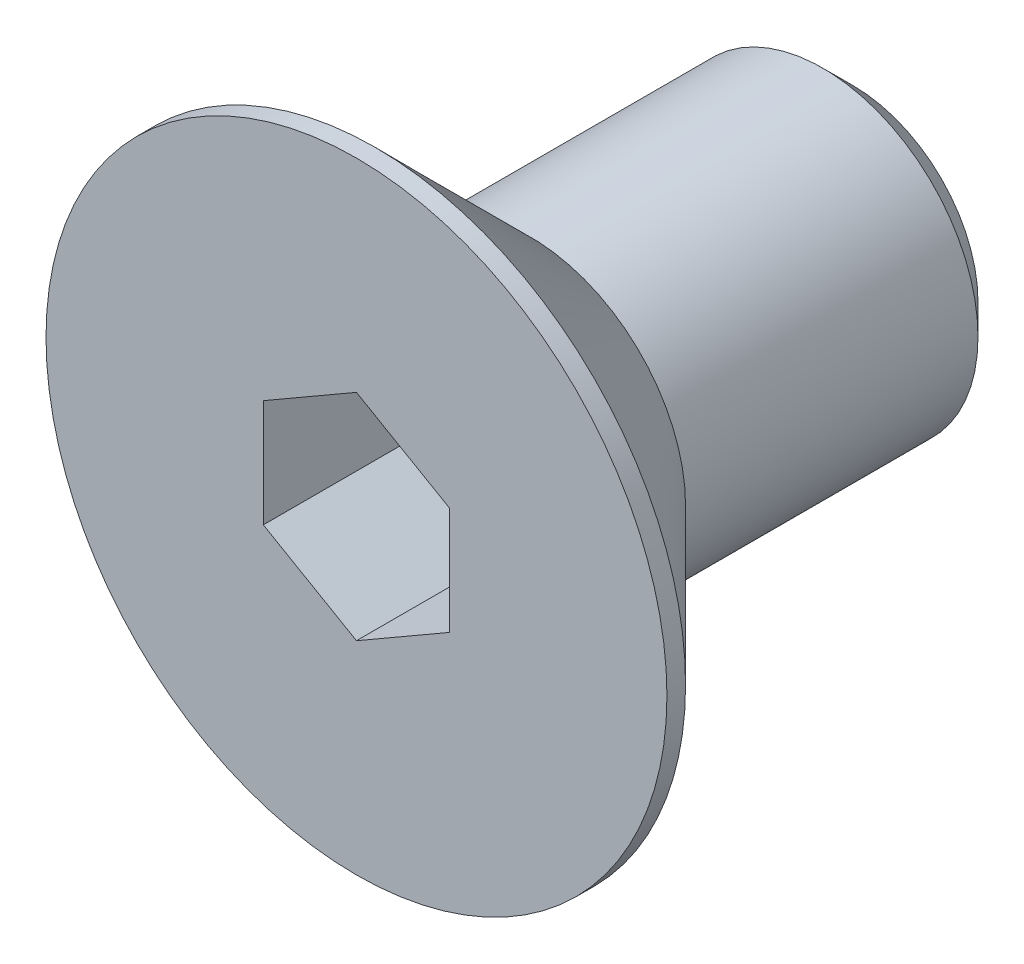
ISO-10303-21;
HEADER;
FILE_DESCRIPTION(('STEP AP214'),'2;1');
FILE_NAME('part.step','',(''),(''),'','','');
FILE_SCHEMA(('AUTOMOTIVE_DESIGN { 1 0 10303 214 1 1 1 1 }'));
ENDSEC;
DATA;
#1=APPLICATION_CONTEXT('core data for automotive mechanical design processes');
#2=APPLICATION_PROTOCOL_DEFINITION('international standard','automotive_design',2000,#1);
#3=PRODUCT_CONTEXT('',#1,'mechanical');
#4=PRODUCT('Part','Part','',(#3));
#5=PRODUCT_RELATED_PRODUCT_CATEGORY('part','',(#4));
#6=PRODUCT_DEFINITION_FORMATION('','',#4);
#7=PRODUCT_DEFINITION_CONTEXT('part definition',#1,'design');
#8=PRODUCT_DEFINITION('design','',#6,#7);
#9=PRODUCT_DEFINITION_SHAPE('','',#8);
#10=(LENGTH_UNIT() NAMED_UNIT(*) SI_UNIT(.MILLI.,.METRE.));
#11=(NAMED_UNIT(*) PLANE_ANGLE_UNIT() SI_UNIT($,.RADIAN.));
#12=(NAMED_UNIT(*) SI_UNIT($,.STERADIAN.) SOLID_ANGLE_UNIT());
#13=UNCERTAINTY_MEASURE_WITH_UNIT(LENGTH_MEASURE(1.E-05),#10,'distance_accuracy_value','');
#14=(GEOMETRIC_REPRESENTATION_CONTEXT(3) GLOBAL_UNCERTAINTY_ASSIGNED_CONTEXT((#13)) GLOBAL_UNIT_ASSIGNED_CONTEXT((#10,
#11,#12)) REPRESENTATION_CONTEXT('',''));
#15=CARTESIAN_POINT('',(0.,0.,0.));
#16=DIRECTION('',(0.,0.,1.));
#17=DIRECTION('',(1.,0.,0.));
#18=AXIS2_PLACEMENT_3D('',#15,#16,#17);
#19=CARTESIAN_POINT('',(0.,0.,-4.24));
#20=DIRECTION('',(0.,0.,1.));
#21=DIRECTION('',(1.,0.,0.));
#22=AXIS2_PLACEMENT_3D('',#19,#20,#21);
#23=PLANE('',#22);
#24=DIRECTION('',(0.,-1.,0.));
#25=VECTOR('',#24,1.);
#26=CARTESIAN_POINT('',(-17.5,29.2660254037844,-4.24));
#27=LINE('',#26,#25);
#28=CARTESIAN_POINT('',(-17.5,29.2660254037844,-4.24));
#29=VERTEX_POINT('',#28);
#30=CARTESIAN_POINT('',(-17.5,28.4,-4.24000000000797));
#31=VERTEX_POINT('',#30);
#32=EDGE_CURVE('E263',#29,#31,#27,.T.);
#33=ORIENTED_EDGE('',*,*,#32,.T.);
#34=CARTESIAN_POINT('',(-16.,28.4,-4.24000000000797));
#35=DIRECTION('',(0.,0.,-1.));
#36=DIRECTION('',(-1.,0.,0.));
#37=AXIS2_PLACEMENT_3D('',#34,#35,#36);
#38=CIRCLE('',#37,1.49999999998808);
#39=CARTESIAN_POINT('',(-16.7499999999941,29.6990381056663,-4.24000000000797));
#40=VERTEX_POINT('',#39);
#41=EDGE_CURVE('E50',#31,#40,#38,.T.);
#42=ORIENTED_EDGE('',*,*,#41,.T.);
#43=DIRECTION('',(-0.866025403784432,-0.500000000000012,0.));
#44=VECTOR('',#43,1.);
#45=CARTESIAN_POINT('',(-16.,30.1320508075689,-4.24));
#46=LINE('',#45,#44);
#47=EDGE_CURVE('E252',#40,#29,#46,.T.);
#48=ORIENTED_EDGE('',*,*,#47,.T.);
#49=EDGE_LOOP('',(#33,#42,#48));
#50=FACE_BOUND('',#49,.T.);
#51=ADVANCED_FACE('F35',(#50),#23,.T.);
#52=CARTESIAN_POINT('',(-16.,30.1320508075689,-4.24));
#53=VERTEX_POINT('',#52);
#54=EDGE_CURVE('E274',#53,#40,#46,.T.);
#55=ORIENTED_EDGE('',*,*,#54,.T.);
#56=CARTESIAN_POINT('',(-15.250000000006,29.6990381056663,-4.24000000000797));
#57=VERTEX_POINT('',#56);
#58=EDGE_CURVE('E196',#40,#57,#38,.T.);
#59=ORIENTED_EDGE('',*,*,#58,.T.);
#60=DIRECTION('',(-0.866025403784438,0.5,0.));
#61=VECTOR('',#60,1.);
#62=CARTESIAN_POINT('',(-14.5,29.2660254037844,-4.24));
#63=LINE('',#62,#61);
#64=EDGE_CURVE('E236',#57,#53,#63,.T.);
#65=ORIENTED_EDGE('',*,*,#64,.T.);
#66=EDGE_LOOP('',(#55,#59,#65));
#67=FACE_BOUND('',#66,.T.);
#68=ADVANCED_FACE('F122',(#67),#23,.T.);
#69=CARTESIAN_POINT('',(-14.5,29.2660254037844,-4.24));
#70=VERTEX_POINT('',#69);
#71=EDGE_CURVE('E237',#70,#57,#63,.T.);
#72=ORIENTED_EDGE('',*,*,#71,.T.);
#73=CARTESIAN_POINT('',(-14.5000000000119,28.4,-4.24000000000797));
#74=VERTEX_POINT('',#73);
#75=EDGE_CURVE('E199',#57,#74,#38,.T.);
#76=ORIENTED_EDGE('',*,*,#75,.T.);
#77=DIRECTION('',(0.,1.,0.));
#78=VECTOR('',#77,1.);
#79=CARTESIAN_POINT('',(-14.5,27.5339745962156,-4.24));
#80=LINE('',#79,#78);
#81=EDGE_CURVE('E231',#74,#70,#80,.T.);
#82=ORIENTED_EDGE('',*,*,#81,.T.);
#83=EDGE_LOOP('',(#72,#76,#82));
#84=FACE_BOUND('',#83,.T.);
#85=ADVANCED_FACE('F127',(#84),#23,.T.);
#86=CARTESIAN_POINT('',(-14.5,27.5339745962156,-4.24));
#87=VERTEX_POINT('',#86);
#88=EDGE_CURVE('E222',#87,#74,#80,.T.);
#89=ORIENTED_EDGE('',*,*,#88,.T.);
#90=CARTESIAN_POINT('',(-15.2500000000059,27.1009618943337,-4.24000000000797));
#91=VERTEX_POINT('',#90);
#92=EDGE_CURVE('E204',#74,#91,#38,.T.);
#93=ORIENTED_EDGE('',*,*,#92,.T.);
#94=DIRECTION('',(0.866025403784427,0.50000000000002,0.));
#95=VECTOR('',#94,1.);
#96=CARTESIAN_POINT('',(-16.,26.6679491924311,-4.24));
#97=LINE('',#96,#95);
#98=EDGE_CURVE('E219',#91,#87,#97,.T.);
#99=ORIENTED_EDGE('',*,*,#98,.T.);
#100=EDGE_LOOP('',(#89,#93,#99));
#101=FACE_BOUND('',#100,.T.);
#102=ADVANCED_FACE('F174',(#101),#23,.T.);
#103=CARTESIAN_POINT('',(-16.,26.6679491924311,-4.24));
#104=VERTEX_POINT('',#103);
#105=EDGE_CURVE('E225',#104,#91,#97,.T.);
#106=ORIENTED_EDGE('',*,*,#105,.T.);
#107=CARTESIAN_POINT('',(-16.7499999999941,27.1009618943337,-4.24000000000797));
#108=VERTEX_POINT('',#107);
#109=EDGE_CURVE('E209',#91,#108,#38,.T.);
#110=ORIENTED_EDGE('',*,*,#109,.T.);
#111=DIRECTION('',(0.866025403784423,-0.500000000000027,0.));
#112=VECTOR('',#111,1.);
#113=CARTESIAN_POINT('',(-17.5,27.5339745962156,-4.24));
#114=LINE('',#113,#112);
#115=EDGE_CURVE('E229',#108,#104,#114,.T.);
#116=ORIENTED_EDGE('',*,*,#115,.T.);
#117=EDGE_LOOP('',(#106,#110,#116));
#118=FACE_BOUND('',#117,.T.);
#119=ADVANCED_FACE('F120',(#118),#23,.T.);
#120=CARTESIAN_POINT('',(-16.,28.4,-2.));
#121=DIRECTION('',(0.,0.,-1.));
#122=DIRECTION('',(-1.,0.,0.));
#123=AXIS2_PLACEMENT_3D('',#120,#121,#122);
#124=CYLINDRICAL_SURFACE('',#123,5.00000000004061);
#125=CARTESIAN_POINT('',(-16.,28.4,-2.));
#126=DIRECTION('',(0.,0.,-1.));
#127=DIRECTION('',(-1.,0.,0.));
#128=AXIS2_PLACEMENT_3D('',#125,#126,#127);
#129=CIRCLE('',#128,5.00000000004061);
#130=CARTESIAN_POINT('',(-21.0000000000406,28.4,-2.));
#131=VERTEX_POINT('',#130);
#132=EDGE_CURVE('E179',#131,#131,#129,.T.);
#133=ORIENTED_EDGE('',*,*,#132,.T.);
#134=EDGE_LOOP('',(#133));
#135=FACE_BOUND('',#134,.T.);
#136=CARTESIAN_POINT('',(-16.,28.4,-2.30000000000505));
#137=DIRECTION('',(0.,0.,-1.));
#138=DIRECTION('',(-1.,0.,0.));
#139=AXIS2_PLACEMENT_3D('',#136,#137,#138);
#140=CIRCLE('',#139,5.00000000004061);
#141=CARTESIAN_POINT('',(-21.0000000000406,28.4,-2.30000000000505));
#142=VERTEX_POINT('',#141);
#143=EDGE_CURVE('E182',#142,#142,#140,.T.);
#144=ORIENTED_EDGE('',*,*,#143,.F.);
#145=EDGE_LOOP('',(#144));
#146=FACE_BOUND('',#145,.T.);
#147=ADVANCED_FACE('F167',(#135,#146),#124,.T.);
#148=CARTESIAN_POINT('',(-10.9999999999594,28.4,-2.));
#149=DIRECTION('',(0.,0.,1.));
#150=DIRECTION('',(1.,0.,0.));
#151=AXIS2_PLACEMENT_3D('',#148,#149,#150);
#152=PLANE('',#151);
#153=DIRECTION('',(-0.866025403784432,-0.500000000000012,0.));
#154=VECTOR('',#153,1.);
#155=CARTESIAN_POINT('',(-16.,30.1320508075689,-2.));
#156=LINE('',#155,#154);
#157=CARTESIAN_POINT('',(-16.,30.1320508075689,-2.));
#158=VERTEX_POINT('',#157);
#159=CARTESIAN_POINT('',(-17.5,29.2660254037844,-2.));
#160=VERTEX_POINT('',#159);
#161=EDGE_CURVE('E58',#158,#160,#156,.T.);
#162=ORIENTED_EDGE('',*,*,#161,.F.);
#163=DIRECTION('',(-0.866025403784438,0.5,0.));
#164=VECTOR('',#163,1.);
#165=CARTESIAN_POINT('',(-14.5,29.2660254037844,-2.));
#166=LINE('',#165,#164);
#167=CARTESIAN_POINT('',(-14.5,29.2660254037844,-2.));
#168=VERTEX_POINT('',#167);
#169=EDGE_CURVE('E250',#168,#158,#166,.T.);
#170=ORIENTED_EDGE('',*,*,#169,.F.);
#171=DIRECTION('',(0.,1.,0.));
#172=VECTOR('',#171,1.);
#173=CARTESIAN_POINT('',(-14.5,27.5339745962156,-2.));
#174=LINE('',#173,#172);
#175=CARTESIAN_POINT('',(-14.5,27.5339745962156,-2.));
#176=VERTEX_POINT('',#175);
#177=EDGE_CURVE('E247',#176,#168,#174,.T.);
#178=ORIENTED_EDGE('',*,*,#177,.F.);
#179=DIRECTION('',(0.866025403784427,0.50000000000002,0.));
#180=VECTOR('',#179,1.);
#181=CARTESIAN_POINT('',(-16.,26.6679491924311,-2.));
#182=LINE('',#181,#180);
#183=CARTESIAN_POINT('',(-16.,26.6679491924311,-2.));
#184=VERTEX_POINT('',#183);
#185=EDGE_CURVE('E245',#184,#176,#182,.T.);
#186=ORIENTED_EDGE('',*,*,#185,.F.);
#187=DIRECTION('',(0.866025403784423,-0.500000000000027,0.));
#188=VECTOR('',#187,1.);
#189=CARTESIAN_POINT('',(-17.5,27.5339745962156,-2.));
#190=LINE('',#189,#188);
#191=CARTESIAN_POINT('',(-17.5,27.5339745962156,-2.));
#192=VERTEX_POINT('',#191);
#193=EDGE_CURVE('E242',#192,#184,#190,.T.);
#194=ORIENTED_EDGE('',*,*,#193,.F.);
#195=DIRECTION('',(0.,-1.,0.));
#196=VECTOR('',#195,1.);
#197=CARTESIAN_POINT('',(-17.5,29.2660254037844,-2.));
#198=LINE('',#197,#196);
#199=EDGE_CURVE('E207',#160,#192,#198,.T.);
#200=ORIENTED_EDGE('',*,*,#199,.F.);
#201=EDGE_LOOP('',(#162,#170,#178,#186,#194,#200));
#202=FACE_BOUND('',#201,.T.);
#203=ORIENTED_EDGE('',*,*,#132,.F.);
#204=EDGE_LOOP('',(#203));
#205=FACE_BOUND('',#204,.T.);
#206=ADVANCED_FACE('F164',(#202,#205),#152,.T.);
#207=CARTESIAN_POINT('',(-16.,28.4,-10.));
#208=DIRECTION('',(0.,0.,-1.));
#209=DIRECTION('',(-1.,0.,0.));
#210=AXIS2_PLACEMENT_3D('',#207,#208,#209);
#211=PLANE('',#210);
#212=CARTESIAN_POINT('',(-16.,28.4,-10.));
#213=DIRECTION('',(0.,0.,-1.));
#214=DIRECTION('',(-1.,0.,0.));
#215=AXIS2_PLACEMENT_3D('',#212,#213,#214);
#216=CIRCLE('',#215,2.00950000009952);
#217=CARTESIAN_POINT('',(-18.0095000000995,28.4,-10.));
#218=VERTEX_POINT('',#217);
#219=EDGE_CURVE('E43',#218,#218,#216,.T.);
#220=ORIENTED_EDGE('',*,*,#219,.T.);
#221=EDGE_LOOP('',(#220));
#222=FACE_BOUND('',#221,.T.);
#223=ADVANCED_FACE('F160',(#222),#211,.T.);
#224=CARTESIAN_POINT('',(-16.,28.4,-2.));
#225=DIRECTION('',(0.,0.,-1.));
#226=DIRECTION('',(-1.,0.,0.));
#227=AXIS2_PLACEMENT_3D('',#224,#225,#226);
#228=CYLINDRICAL_SURFACE('',#227,2.5);
#229=CARTESIAN_POINT('',(-16.,28.4,-9.50950000004267));
#230=DIRECTION('',(0.,0.,-1.));
#231=DIRECTION('',(-1.,0.,0.));
#232=AXIS2_PLACEMENT_3D('',#229,#230,#231);
#233=CIRCLE('',#232,2.5);
#234=CARTESIAN_POINT('',(-18.5,28.4,-9.50950000004267));
#235=VERTEX_POINT('',#234);
#236=EDGE_CURVE('E11',#235,#235,#233,.F.);
#237=ORIENTED_EDGE('',*,*,#236,.T.);
#238=EDGE_LOOP('',(#237));
#239=FACE_BOUND('',#238,.T.);
#240=CARTESIAN_POINT('',(-16.,28.4,-4.80000000004566));
#241=DIRECTION('',(0.,0.,-1.));
#242=DIRECTION('',(-1.,0.,0.));
#243=AXIS2_PLACEMENT_3D('',#240,#241,#242);
#244=CIRCLE('',#243,2.5);
#245=CARTESIAN_POINT('',(-18.5,28.4,-4.80000000004566));
#246=VERTEX_POINT('',#245);
#247=EDGE_CURVE('E183',#246,#246,#244,.T.);
#248=ORIENTED_EDGE('',*,*,#247,.T.);
#249=EDGE_LOOP('',(#248));
#250=FACE_BOUND('',#249,.T.);
#251=ADVANCED_FACE('F156',(#239,#250),#228,.T.);
#252=CARTESIAN_POINT('',(-16.,28.4,-4.80000000004566));
#253=DIRECTION('',(0.,0.,1.));
#254=DIRECTION('',(1.,0.,0.));
#255=AXIS2_PLACEMENT_3D('',#252,#253,#254);
#256=CONICAL_SURFACE('',#255,2.5,0.785398163397448);
#257=ORIENTED_EDGE('',*,*,#143,.T.);
#258=EDGE_LOOP('',(#257));
#259=FACE_BOUND('',#258,.T.);
#260=ORIENTED_EDGE('',*,*,#247,.F.);
#261=EDGE_LOOP('',(#260));
#262=FACE_BOUND('',#261,.T.);
#263=ADVANCED_FACE('F153',(#259,#262),#256,.T.);
#264=CARTESIAN_POINT('',(-16.,30.1320508075689,-4.24));
#265=DIRECTION('',(-0.500000000000012,0.866025403784432,0.));
#266=DIRECTION('',(-0.866025403784432,-0.500000000000012,0.));
#267=AXIS2_PLACEMENT_3D('',#264,#265,#266);
#268=PLANE('',#267);
#269=ORIENTED_EDGE('',*,*,#161,.T.);
#270=DIRECTION('',(0.,0.,1.));
#271=VECTOR('',#270,1.);
#272=CARTESIAN_POINT('',(-17.5,29.2660254037844,-4.24));
#273=LINE('',#272,#271);
#274=EDGE_CURVE('E191',#29,#160,#273,.T.);
#275=ORIENTED_EDGE('',*,*,#274,.F.);
#276=ORIENTED_EDGE('',*,*,#47,.F.);
#277=ORIENTED_EDGE('',*,*,#54,.F.);
#278=DIRECTION('',(0.,0.,1.));
#279=VECTOR('',#278,1.);
#280=CARTESIAN_POINT('',(-16.,30.1320508075689,-4.24));
#281=LINE('',#280,#279);
#282=EDGE_CURVE('E184',#53,#158,#281,.T.);
#283=ORIENTED_EDGE('',*,*,#282,.T.);
#284=EDGE_LOOP('',(#269,#275,#276,#277,#283));
#285=FACE_BOUND('',#284,.T.);
#286=ADVANCED_FACE('F135',(#285),#268,.F.);
#287=CARTESIAN_POINT('',(-14.5,29.2660254037844,-4.24));
#288=DIRECTION('',(0.5,0.866025403784438,0.));
#289=DIRECTION('',(-0.866025403784439,0.5,0.));
#290=AXIS2_PLACEMENT_3D('',#287,#288,#289);
#291=PLANE('',#290);
#292=ORIENTED_EDGE('',*,*,#169,.T.);
#293=ORIENTED_EDGE('',*,*,#282,.F.);
#294=ORIENTED_EDGE('',*,*,#64,.F.);
#295=ORIENTED_EDGE('',*,*,#71,.F.);
#296=DIRECTION('',(0.,0.,1.));
#297=VECTOR('',#296,1.);
#298=CARTESIAN_POINT('',(-14.5,29.2660254037844,-4.24));
#299=LINE('',#298,#297);
#300=EDGE_CURVE('E188',#70,#168,#299,.T.);
#301=ORIENTED_EDGE('',*,*,#300,.T.);
#302=EDGE_LOOP('',(#292,#293,#294,#295,#301));
#303=FACE_BOUND('',#302,.T.);
#304=ADVANCED_FACE('F131',(#303),#291,.F.);
#305=CARTESIAN_POINT('',(-14.5,27.5339745962156,-4.24));
#306=DIRECTION('',(1.,0.,0.));
#307=DIRECTION('',(0.,1.,0.));
#308=AXIS2_PLACEMENT_3D('',#305,#306,#307);
#309=PLANE('',#308);
#310=ORIENTED_EDGE('',*,*,#177,.T.);
#311=ORIENTED_EDGE('',*,*,#300,.F.);
#312=ORIENTED_EDGE('',*,*,#81,.F.);
#313=ORIENTED_EDGE('',*,*,#88,.F.);
#314=DIRECTION('',(0.,0.,1.));
#315=VECTOR('',#314,1.);
#316=CARTESIAN_POINT('',(-14.5,27.5339745962156,-4.24));
#317=LINE('',#316,#315);
#318=EDGE_CURVE('E226',#87,#176,#317,.T.);
#319=ORIENTED_EDGE('',*,*,#318,.T.);
#320=EDGE_LOOP('',(#310,#311,#312,#313,#319));
#321=FACE_BOUND('',#320,.T.);
#322=ADVANCED_FACE('F134',(#321),#309,.F.);
#323=CARTESIAN_POINT('',(-16.,26.6679491924311,-4.24));
#324=DIRECTION('',(0.50000000000002,-0.866025403784427,0.));
#325=DIRECTION('',(0.866025403784427,0.50000000000002,0.));
#326=AXIS2_PLACEMENT_3D('',#323,#324,#325);
#327=PLANE('',#326);
#328=ORIENTED_EDGE('',*,*,#185,.T.);
#329=ORIENTED_EDGE('',*,*,#318,.F.);
#330=ORIENTED_EDGE('',*,*,#98,.F.);
#331=ORIENTED_EDGE('',*,*,#105,.F.);
#332=DIRECTION('',(0.,0.,1.));
#333=VECTOR('',#332,1.);
#334=CARTESIAN_POINT('',(-16.,26.6679491924311,-4.24));
#335=LINE('',#334,#333);
#336=EDGE_CURVE('E256',#104,#184,#335,.T.);
#337=ORIENTED_EDGE('',*,*,#336,.T.);
#338=EDGE_LOOP('',(#328,#329,#330,#331,#337));
#339=FACE_BOUND('',#338,.T.);
#340=ADVANCED_FACE('F139',(#339),#327,.F.);
#341=CARTESIAN_POINT('',(-17.5,27.5339745962156,-4.24));
#342=DIRECTION('',(-0.500000000000027,-0.866025403784423,0.));
#343=DIRECTION('',(0.866025403784423,-0.500000000000027,0.));
#344=AXIS2_PLACEMENT_3D('',#341,#342,#343);
#345=PLANE('',#344);
#346=ORIENTED_EDGE('',*,*,#193,.T.);
#347=ORIENTED_EDGE('',*,*,#336,.F.);
#348=ORIENTED_EDGE('',*,*,#115,.F.);
#349=CARTESIAN_POINT('',(-17.5,27.5339745962156,-4.24));
#350=VERTEX_POINT('',#349);
#351=EDGE_CURVE('E227',#350,#108,#114,.T.);
#352=ORIENTED_EDGE('',*,*,#351,.F.);
#353=DIRECTION('',(0.,0.,1.));
#354=VECTOR('',#353,1.);
#355=CARTESIAN_POINT('',(-17.5,27.5339745962156,-4.24));
#356=LINE('',#355,#354);
#357=EDGE_CURVE('E257',#350,#192,#356,.T.);
#358=ORIENTED_EDGE('',*,*,#357,.T.);
#359=EDGE_LOOP('',(#346,#347,#348,#352,#358));
#360=FACE_BOUND('',#359,.T.);
#361=ADVANCED_FACE('F143',(#360),#345,.F.);
#362=CARTESIAN_POINT('',(-17.5,29.2660254037844,-4.24));
#363=DIRECTION('',(-1.,0.,0.));
#364=DIRECTION('',(0.,0.,1.));
#365=AXIS2_PLACEMENT_3D('',#362,#363,#364);
#366=PLANE('',#365);
#367=ORIENTED_EDGE('',*,*,#199,.T.);
#368=ORIENTED_EDGE('',*,*,#357,.F.);
#369=EDGE_CURVE('E275',#31,#350,#27,.T.);
#370=ORIENTED_EDGE('',*,*,#369,.F.);
#371=ORIENTED_EDGE('',*,*,#32,.F.);
#372=ORIENTED_EDGE('',*,*,#274,.T.);
#373=EDGE_LOOP('',(#367,#368,#370,#371,#372));
#374=FACE_BOUND('',#373,.T.);
#375=ADVANCED_FACE('F117',(#374),#366,.F.);
#376=ORIENTED_EDGE('',*,*,#351,.T.);
#377=EDGE_CURVE('E194',#108,#31,#38,.T.);
#378=ORIENTED_EDGE('',*,*,#377,.T.);
#379=ORIENTED_EDGE('',*,*,#369,.T.);
#380=EDGE_LOOP('',(#376,#378,#379));
#381=FACE_BOUND('',#380,.T.);
#382=ADVANCED_FACE('F110',(#381),#23,.T.);
#383=CARTESIAN_POINT('',(-16.,28.4,-4.64192378880902));
#384=DIRECTION('',(0.,0.,1.));
#385=DIRECTION('',(1.,0.,0.));
#386=AXIS2_PLACEMENT_3D('',#383,#384,#385);
#387=CONICAL_SURFACE('',#386,0.,1.30899693889774);
#388=ORIENTED_EDGE('',*,*,#41,.F.);
#389=ORIENTED_EDGE('',*,*,#377,.F.);
#390=ORIENTED_EDGE('',*,*,#109,.F.);
#391=ORIENTED_EDGE('',*,*,#92,.F.);
#392=ORIENTED_EDGE('',*,*,#75,.F.);
#393=ORIENTED_EDGE('',*,*,#58,.F.);
#394=EDGE_LOOP('',(#388,#389,#390,#391,#392,#393));
#395=FACE_BOUND('',#394,.T.);
#396=CARTESIAN_POINT('',(-16.,28.4,-4.64192378880902));
#397=VERTEX_POINT('',#396);
#398=VERTEX_LOOP('',#397);
#399=FACE_BOUND('',#398,.T.);
#400=ADVANCED_FACE('F108',(#395,#399),#387,.F.);
#401=CARTESIAN_POINT('',(-16.,28.4,-10.));
#402=DIRECTION('',(0.,0.,1.));
#403=DIRECTION('',(1.,0.,0.));
#404=AXIS2_PLACEMENT_3D('',#401,#402,#403);
#405=CONICAL_SURFACE('',#404,2.00950000009951,0.7853981633395);
#406=ORIENTED_EDGE('',*,*,#236,.F.);
#407=EDGE_LOOP('',(#406));
#408=FACE_BOUND('',#407,.T.);
#409=ORIENTED_EDGE('',*,*,#219,.F.);
#410=EDGE_LOOP('',(#409));
#411=FACE_BOUND('',#410,.T.);
#412=ADVANCED_FACE('F37',(#408,#411),#405,.T.);
#413=CLOSED_SHELL('',(#51,#68,#85,#102,#119,#147,#206,#223,#251,#263,#286,#304,#322,#340,#361,
#375,#382,#400,#412));
#414=MANIFOLD_SOLID_BREP('B2',#413);
#415=ADVANCED_BREP_SHAPE_REPRESENTATION('',(#18,#414),#14);
#416=SHAPE_DEFINITION_REPRESENTATION(#9,#415);
ENDSEC;
END-ISO-10303-21;
